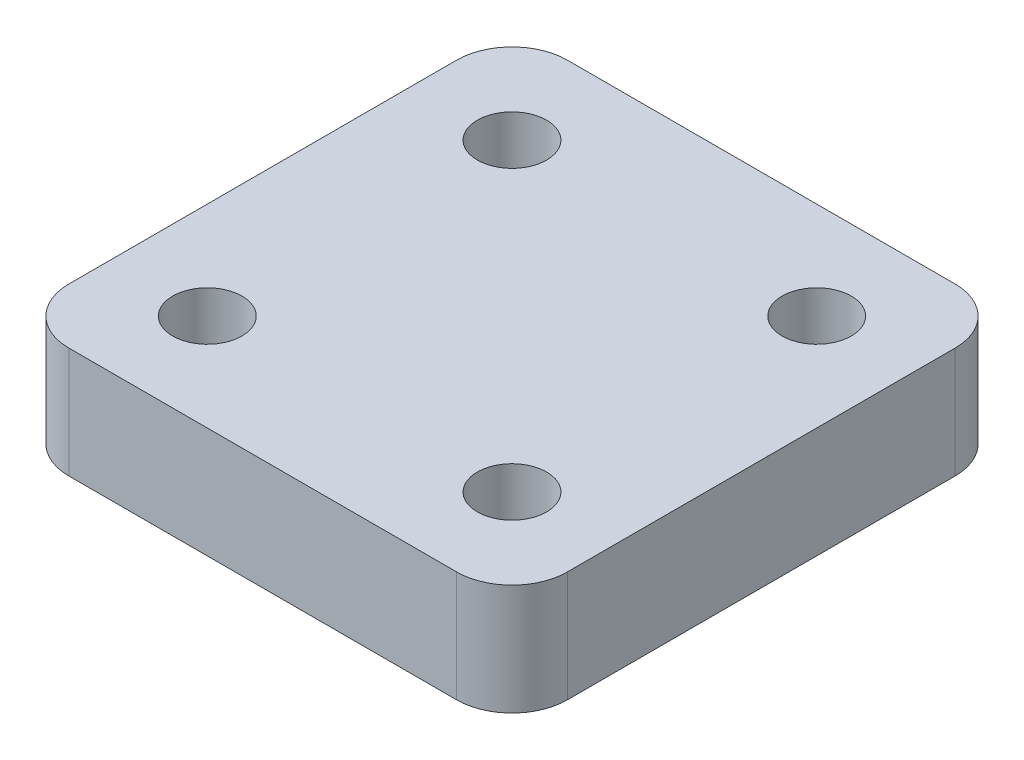
ISO-10303-21;
HEADER;
FILE_DESCRIPTION(('STEP AP214'),'2;1');
FILE_NAME('part.step','',(''),(''),'','','');
FILE_SCHEMA(('AUTOMOTIVE_DESIGN { 1 0 10303 214 1 1 1 1 }'));
ENDSEC;
DATA;
#1=APPLICATION_CONTEXT('core data for automotive mechanical design processes');
#2=APPLICATION_PROTOCOL_DEFINITION('international standard','automotive_design',2000,#1);
#3=PRODUCT_CONTEXT('',#1,'mechanical');
#4=PRODUCT('Part','Part','',(#3));
#5=PRODUCT_RELATED_PRODUCT_CATEGORY('part','',(#4));
#6=PRODUCT_DEFINITION_FORMATION('','',#4);
#7=PRODUCT_DEFINITION_CONTEXT('part definition',#1,'design');
#8=PRODUCT_DEFINITION('design','',#6,#7);
#9=PRODUCT_DEFINITION_SHAPE('','',#8);
#10=(LENGTH_UNIT() NAMED_UNIT(*) SI_UNIT(.MILLI.,.METRE.));
#11=(NAMED_UNIT(*) PLANE_ANGLE_UNIT() SI_UNIT($,.RADIAN.));
#12=(NAMED_UNIT(*) SI_UNIT($,.STERADIAN.) SOLID_ANGLE_UNIT());
#13=UNCERTAINTY_MEASURE_WITH_UNIT(LENGTH_MEASURE(1.E-05),#10,'distance_accuracy_value','');
#14=(GEOMETRIC_REPRESENTATION_CONTEXT(3) GLOBAL_UNCERTAINTY_ASSIGNED_CONTEXT((#13)) GLOBAL_UNIT_ASSIGNED_CONTEXT((#10,
#11,#12)) REPRESENTATION_CONTEXT('',''));
#15=CARTESIAN_POINT('',(0.,0.,0.));
#16=DIRECTION('',(0.,0.,1.));
#17=DIRECTION('',(1.,0.,0.));
#18=AXIS2_PLACEMENT_3D('',#15,#16,#17);
#19=CARTESIAN_POINT('',(700.,400.,-700.));
#20=DIRECTION('',(0.,1.,0.));
#21=DIRECTION('',(0.,0.,1.));
#22=AXIS2_PLACEMENT_3D('',#19,#20,#21);
#23=PLANE('',#22);
#24=CARTESIAN_POINT('',(-550.,400.,-550.));
#25=DIRECTION('',(0.,1.,0.));
#26=DIRECTION('',(0.,0.,1.));
#27=AXIS2_PLACEMENT_3D('',#24,#25,#26);
#28=CIRCLE('',#27,125.);
#29=CARTESIAN_POINT('',(-550.,400.,-425.));
#30=VERTEX_POINT('',#29);
#31=EDGE_CURVE('E193',#30,#30,#28,.T.);
#32=ORIENTED_EDGE('',*,*,#31,.F.);
#33=EDGE_LOOP('',(#32));
#34=FACE_BOUND('',#33,.T.);
#35=CARTESIAN_POINT('',(-550.,400.,550.));
#36=DIRECTION('',(0.,1.,0.));
#37=DIRECTION('',(0.,0.,1.));
#38=AXIS2_PLACEMENT_3D('',#35,#36,#37);
#39=CIRCLE('',#38,125.);
#40=CARTESIAN_POINT('',(-550.,400.,675.));
#41=VERTEX_POINT('',#40);
#42=EDGE_CURVE('E135',#41,#41,#39,.T.);
#43=ORIENTED_EDGE('',*,*,#42,.F.);
#44=EDGE_LOOP('',(#43));
#45=FACE_BOUND('',#44,.T.);
#46=CARTESIAN_POINT('',(700.,400.,-700.));
#47=DIRECTION('',(0.,1.,0.));
#48=DIRECTION('',(0.,0.,1.));
#49=AXIS2_PLACEMENT_3D('',#46,#47,#48);
#50=CIRCLE('',#49,200.);
#51=CARTESIAN_POINT('',(900.,400.,-699.999999999999));
#52=VERTEX_POINT('',#51);
#53=CARTESIAN_POINT('',(699.999999999998,400.,-900.));
#54=VERTEX_POINT('',#53);
#55=EDGE_CURVE('E146',#52,#54,#50,.T.);
#56=ORIENTED_EDGE('',*,*,#55,.T.);
#57=DIRECTION('',(-1.,0.,0.));
#58=VECTOR('',#57,1.);
#59=CARTESIAN_POINT('',(-699.999999999999,400.,-900.));
#60=LINE('',#59,#58);
#61=CARTESIAN_POINT('',(-700.,400.,-900.));
#62=VERTEX_POINT('',#61);
#63=EDGE_CURVE('E94',#54,#62,#60,.T.);
#64=ORIENTED_EDGE('',*,*,#63,.T.);
#65=CARTESIAN_POINT('',(-700.,400.,-700.));
#66=DIRECTION('',(0.,1.,0.));
#67=DIRECTION('',(0.,0.,-1.));
#68=AXIS2_PLACEMENT_3D('',#65,#66,#67);
#69=CIRCLE('',#68,200.);
#70=CARTESIAN_POINT('',(-900.,400.,-699.999999999999));
#71=VERTEX_POINT('',#70);
#72=EDGE_CURVE('E178',#62,#71,#69,.T.);
#73=ORIENTED_EDGE('',*,*,#72,.T.);
#74=DIRECTION('',(0.,0.,1.));
#75=VECTOR('',#74,1.);
#76=CARTESIAN_POINT('',(-900.,400.,-699.999999999999));
#77=LINE('',#76,#75);
#78=CARTESIAN_POINT('',(-900.,400.,699.999999999999));
#79=VERTEX_POINT('',#78);
#80=EDGE_CURVE('E177',#71,#79,#77,.T.);
#81=ORIENTED_EDGE('',*,*,#80,.T.);
#82=CARTESIAN_POINT('',(-700.,400.,700.));
#83=DIRECTION('',(0.,1.,0.));
#84=DIRECTION('',(0.,0.,1.));
#85=AXIS2_PLACEMENT_3D('',#82,#83,#84);
#86=CIRCLE('',#85,200.);
#87=CARTESIAN_POINT('',(-699.999999999999,400.,900.));
#88=VERTEX_POINT('',#87);
#89=EDGE_CURVE('E113',#79,#88,#86,.T.);
#90=ORIENTED_EDGE('',*,*,#89,.T.);
#91=DIRECTION('',(1.,0.,0.));
#92=VECTOR('',#91,1.);
#93=CARTESIAN_POINT('',(-699.999999999999,400.,900.));
#94=LINE('',#93,#92);
#95=CARTESIAN_POINT('',(699.999999999999,400.,900.));
#96=VERTEX_POINT('',#95);
#97=EDGE_CURVE('E107',#88,#96,#94,.T.);
#98=ORIENTED_EDGE('',*,*,#97,.T.);
#99=CARTESIAN_POINT('',(700.,400.,700.));
#100=DIRECTION('',(0.,1.,0.));
#101=DIRECTION('',(0.,0.,-1.));
#102=AXIS2_PLACEMENT_3D('',#99,#100,#101);
#103=CIRCLE('',#102,200.);
#104=CARTESIAN_POINT('',(900.,400.,699.999999999999));
#105=VERTEX_POINT('',#104);
#106=EDGE_CURVE('E111',#96,#105,#103,.T.);
#107=ORIENTED_EDGE('',*,*,#106,.T.);
#108=DIRECTION('',(0.,0.,-1.));
#109=VECTOR('',#108,1.);
#110=CARTESIAN_POINT('',(900.,400.,699.999999999999));
#111=LINE('',#110,#109);
#112=EDGE_CURVE('E50',#105,#52,#111,.T.);
#113=ORIENTED_EDGE('',*,*,#112,.T.);
#114=EDGE_LOOP('',(#56,#64,#73,#81,#90,#98,#107,#113));
#115=FACE_BOUND('',#114,.T.);
#116=CARTESIAN_POINT('',(550.,400.,550.));
#117=DIRECTION('',(0.,1.,0.));
#118=DIRECTION('',(0.,0.,1.));
#119=AXIS2_PLACEMENT_3D('',#116,#117,#118);
#120=CIRCLE('',#119,125.);
#121=CARTESIAN_POINT('',(550.,400.,675.));
#122=VERTEX_POINT('',#121);
#123=EDGE_CURVE('E187',#122,#122,#120,.T.);
#124=ORIENTED_EDGE('',*,*,#123,.F.);
#125=EDGE_LOOP('',(#124));
#126=FACE_BOUND('',#125,.T.);
#127=CARTESIAN_POINT('',(550.,400.,-550.));
#128=DIRECTION('',(0.,1.,0.));
#129=DIRECTION('',(0.,0.,1.));
#130=AXIS2_PLACEMENT_3D('',#127,#128,#129);
#131=CIRCLE('',#130,125.);
#132=CARTESIAN_POINT('',(550.,400.,-425.));
#133=VERTEX_POINT('',#132);
#134=EDGE_CURVE('E199',#133,#133,#131,.T.);
#135=ORIENTED_EDGE('',*,*,#134,.F.);
#136=EDGE_LOOP('',(#135));
#137=FACE_BOUND('',#136,.T.);
#138=ADVANCED_FACE('F33',(#34,#45,#115,#126,#137),#23,.T.);
#139=CARTESIAN_POINT('',(700.,0.,-700.));
#140=DIRECTION('',(0.,1.,0.));
#141=DIRECTION('',(0.,0.,1.));
#142=AXIS2_PLACEMENT_3D('',#139,#140,#141);
#143=PLANE('',#142);
#144=CARTESIAN_POINT('',(0.,0.,0.));
#145=DIRECTION('',(0.,1.,0.));
#146=DIRECTION('',(0.,0.,1.));
#147=AXIS2_PLACEMENT_3D('',#144,#145,#146);
#148=CIRCLE('',#147,540.);
#149=CARTESIAN_POINT('',(0.,0.,540.));
#150=VERTEX_POINT('',#149);
#151=EDGE_CURVE('E11',#150,#150,#148,.F.);
#152=ORIENTED_EDGE('',*,*,#151,.F.);
#153=EDGE_LOOP('',(#152));
#154=FACE_BOUND('',#153,.T.);
#155=CARTESIAN_POINT('',(700.,0.,-700.));
#156=DIRECTION('',(0.,1.,0.));
#157=DIRECTION('',(0.,0.,1.));
#158=AXIS2_PLACEMENT_3D('',#155,#156,#157);
#159=CIRCLE('',#158,200.);
#160=CARTESIAN_POINT('',(900.,0.,-699.999999999999));
#161=VERTEX_POINT('',#160);
#162=CARTESIAN_POINT('',(699.999999999998,0.,-900.));
#163=VERTEX_POINT('',#162);
#164=EDGE_CURVE('E131',#161,#163,#159,.T.);
#165=ORIENTED_EDGE('',*,*,#164,.F.);
#166=DIRECTION('',(0.,0.,-1.));
#167=VECTOR('',#166,1.);
#168=CARTESIAN_POINT('',(900.,0.,699.999999999999));
#169=LINE('',#168,#167);
#170=CARTESIAN_POINT('',(900.,0.,699.999999999999));
#171=VERTEX_POINT('',#170);
#172=EDGE_CURVE('E85',#171,#161,#169,.T.);
#173=ORIENTED_EDGE('',*,*,#172,.F.);
#174=CARTESIAN_POINT('',(700.,0.,700.));
#175=DIRECTION('',(0.,1.,0.));
#176=DIRECTION('',(0.,0.,-1.));
#177=AXIS2_PLACEMENT_3D('',#174,#175,#176);
#178=CIRCLE('',#177,200.);
#179=CARTESIAN_POINT('',(699.999999999999,0.,900.));
#180=VERTEX_POINT('',#179);
#181=EDGE_CURVE('E79',#180,#171,#178,.T.);
#182=ORIENTED_EDGE('',*,*,#181,.F.);
#183=DIRECTION('',(1.,0.,0.));
#184=VECTOR('',#183,1.);
#185=CARTESIAN_POINT('',(-699.999999999999,0.,900.));
#186=LINE('',#185,#184);
#187=CARTESIAN_POINT('',(-699.999999999999,0.,900.));
#188=VERTEX_POINT('',#187);
#189=EDGE_CURVE('E121',#188,#180,#186,.T.);
#190=ORIENTED_EDGE('',*,*,#189,.F.);
#191=CARTESIAN_POINT('',(-700.,0.,700.));
#192=DIRECTION('',(0.,1.,0.));
#193=DIRECTION('',(0.,0.,1.));
#194=AXIS2_PLACEMENT_3D('',#191,#192,#193);
#195=CIRCLE('',#194,200.);
#196=CARTESIAN_POINT('',(-900.,0.,699.999999999999));
#197=VERTEX_POINT('',#196);
#198=EDGE_CURVE('E141',#197,#188,#195,.T.);
#199=ORIENTED_EDGE('',*,*,#198,.F.);
#200=DIRECTION('',(0.,0.,1.));
#201=VECTOR('',#200,1.);
#202=CARTESIAN_POINT('',(-900.,0.,-699.999999999999));
#203=LINE('',#202,#201);
#204=CARTESIAN_POINT('',(-900.,0.,-699.999999999999));
#205=VERTEX_POINT('',#204);
#206=EDGE_CURVE('E139',#205,#197,#203,.T.);
#207=ORIENTED_EDGE('',*,*,#206,.F.);
#208=CARTESIAN_POINT('',(-700.,0.,-700.));
#209=DIRECTION('',(0.,1.,0.));
#210=DIRECTION('',(0.,0.,-1.));
#211=AXIS2_PLACEMENT_3D('',#208,#209,#210);
#212=CIRCLE('',#211,200.);
#213=CARTESIAN_POINT('',(-700.,0.,-900.));
#214=VERTEX_POINT('',#213);
#215=EDGE_CURVE('E137',#214,#205,#212,.T.);
#216=ORIENTED_EDGE('',*,*,#215,.F.);
#217=DIRECTION('',(-1.,0.,0.));
#218=VECTOR('',#217,1.);
#219=CARTESIAN_POINT('',(-699.999999999999,0.,-900.));
#220=LINE('',#219,#218);
#221=EDGE_CURVE('E134',#163,#214,#220,.T.);
#222=ORIENTED_EDGE('',*,*,#221,.F.);
#223=EDGE_LOOP('',(#165,#173,#182,#190,#199,#207,#216,#222));
#224=FACE_BOUND('',#223,.T.);
#225=CARTESIAN_POINT('',(-550.,0.,550.));
#226=DIRECTION('',(0.,1.,0.));
#227=DIRECTION('',(0.,0.,1.));
#228=AXIS2_PLACEMENT_3D('',#225,#226,#227);
#229=CIRCLE('',#228,125.);
#230=CARTESIAN_POINT('',(-550.,0.,675.));
#231=VERTEX_POINT('',#230);
#232=EDGE_CURVE('E184',#231,#231,#229,.T.);
#233=ORIENTED_EDGE('',*,*,#232,.T.);
#234=EDGE_LOOP('',(#233));
#235=FACE_BOUND('',#234,.T.);
#236=CARTESIAN_POINT('',(550.,0.,550.));
#237=DIRECTION('',(0.,1.,0.));
#238=DIRECTION('',(0.,0.,1.));
#239=AXIS2_PLACEMENT_3D('',#236,#237,#238);
#240=CIRCLE('',#239,125.);
#241=CARTESIAN_POINT('',(550.,0.,675.));
#242=VERTEX_POINT('',#241);
#243=EDGE_CURVE('E190',#242,#242,#240,.T.);
#244=ORIENTED_EDGE('',*,*,#243,.T.);
#245=EDGE_LOOP('',(#244));
#246=FACE_BOUND('',#245,.T.);
#247=CARTESIAN_POINT('',(-550.,0.,-550.));
#248=DIRECTION('',(0.,1.,0.));
#249=DIRECTION('',(0.,0.,1.));
#250=AXIS2_PLACEMENT_3D('',#247,#248,#249);
#251=CIRCLE('',#250,125.);
#252=CARTESIAN_POINT('',(-550.,0.,-425.));
#253=VERTEX_POINT('',#252);
#254=EDGE_CURVE('E196',#253,#253,#251,.T.);
#255=ORIENTED_EDGE('',*,*,#254,.T.);
#256=EDGE_LOOP('',(#255));
#257=FACE_BOUND('',#256,.T.);
#258=CARTESIAN_POINT('',(550.,0.,-550.));
#259=DIRECTION('',(0.,1.,0.));
#260=DIRECTION('',(0.,0.,1.));
#261=AXIS2_PLACEMENT_3D('',#258,#259,#260);
#262=CIRCLE('',#261,125.);
#263=CARTESIAN_POINT('',(550.,0.,-425.));
#264=VERTEX_POINT('',#263);
#265=EDGE_CURVE('E202',#264,#264,#262,.T.);
#266=ORIENTED_EDGE('',*,*,#265,.T.);
#267=EDGE_LOOP('',(#266));
#268=FACE_BOUND('',#267,.T.);
#269=ADVANCED_FACE('F164',(#154,#224,#235,#246,#257,#268),#143,.F.);
#270=CARTESIAN_POINT('',(700.,400.,-700.));
#271=DIRECTION('',(0.,-1.,0.));
#272=DIRECTION('',(0.,0.,-1.));
#273=AXIS2_PLACEMENT_3D('',#270,#271,#272);
#274=CYLINDRICAL_SURFACE('',#273,200.);
#275=ORIENTED_EDGE('',*,*,#164,.T.);
#276=DIRECTION('',(0.,-1.,0.));
#277=VECTOR('',#276,1.);
#278=CARTESIAN_POINT('',(699.999999999998,400.,-900.));
#279=LINE('',#278,#277);
#280=EDGE_CURVE('E42',#54,#163,#279,.T.);
#281=ORIENTED_EDGE('',*,*,#280,.F.);
#282=ORIENTED_EDGE('',*,*,#55,.F.);
#283=DIRECTION('',(0.,-1.,0.));
#284=VECTOR('',#283,1.);
#285=CARTESIAN_POINT('',(900.,400.,-699.999999999999));
#286=LINE('',#285,#284);
#287=EDGE_CURVE('E127',#52,#161,#286,.T.);
#288=ORIENTED_EDGE('',*,*,#287,.T.);
#289=EDGE_LOOP('',(#275,#281,#282,#288));
#290=FACE_BOUND('',#289,.T.);
#291=ADVANCED_FACE('F35',(#290),#274,.T.);
#292=CARTESIAN_POINT('',(-699.999999999999,400.,-900.));
#293=DIRECTION('',(0.,0.,1.));
#294=DIRECTION('',(1.,0.,0.));
#295=AXIS2_PLACEMENT_3D('',#292,#293,#294);
#296=PLANE('',#295);
#297=ORIENTED_EDGE('',*,*,#221,.T.);
#298=DIRECTION('',(0.,-1.,0.));
#299=VECTOR('',#298,1.);
#300=CARTESIAN_POINT('',(-700.,400.,-900.));
#301=LINE('',#300,#299);
#302=EDGE_CURVE('E156',#62,#214,#301,.T.);
#303=ORIENTED_EDGE('',*,*,#302,.F.);
#304=ORIENTED_EDGE('',*,*,#63,.F.);
#305=ORIENTED_EDGE('',*,*,#280,.T.);
#306=EDGE_LOOP('',(#297,#303,#304,#305));
#307=FACE_BOUND('',#306,.T.);
#308=ADVANCED_FACE('F159',(#307),#296,.F.);
#309=CARTESIAN_POINT('',(-700.,400.,-700.));
#310=DIRECTION('',(0.,-1.,0.));
#311=DIRECTION('',(0.,0.,-1.));
#312=AXIS2_PLACEMENT_3D('',#309,#310,#311);
#313=CYLINDRICAL_SURFACE('',#312,200.);
#314=ORIENTED_EDGE('',*,*,#215,.T.);
#315=DIRECTION('',(0.,-1.,0.));
#316=VECTOR('',#315,1.);
#317=CARTESIAN_POINT('',(-900.,400.,-699.999999999999));
#318=LINE('',#317,#316);
#319=EDGE_CURVE('E153',#71,#205,#318,.T.);
#320=ORIENTED_EDGE('',*,*,#319,.F.);
#321=ORIENTED_EDGE('',*,*,#72,.F.);
#322=ORIENTED_EDGE('',*,*,#302,.T.);
#323=EDGE_LOOP('',(#314,#320,#321,#322));
#324=FACE_BOUND('',#323,.T.);
#325=ADVANCED_FACE('F171',(#324),#313,.T.);
#326=CARTESIAN_POINT('',(-900.,400.,-699.999999999999));
#327=DIRECTION('',(1.,0.,0.));
#328=DIRECTION('',(0.,0.,-1.));
#329=AXIS2_PLACEMENT_3D('',#326,#327,#328);
#330=PLANE('',#329);
#331=ORIENTED_EDGE('',*,*,#206,.T.);
#332=DIRECTION('',(0.,-1.,0.));
#333=VECTOR('',#332,1.);
#334=CARTESIAN_POINT('',(-900.,400.,699.999999999999));
#335=LINE('',#334,#333);
#336=EDGE_CURVE('E150',#79,#197,#335,.T.);
#337=ORIENTED_EDGE('',*,*,#336,.F.);
#338=ORIENTED_EDGE('',*,*,#80,.F.);
#339=ORIENTED_EDGE('',*,*,#319,.T.);
#340=EDGE_LOOP('',(#331,#337,#338,#339));
#341=FACE_BOUND('',#340,.T.);
#342=ADVANCED_FACE('F175',(#341),#330,.F.);
#343=CARTESIAN_POINT('',(-700.,400.,700.));
#344=DIRECTION('',(0.,-1.,0.));
#345=DIRECTION('',(0.,0.,-1.));
#346=AXIS2_PLACEMENT_3D('',#343,#344,#345);
#347=CYLINDRICAL_SURFACE('',#346,200.);
#348=ORIENTED_EDGE('',*,*,#198,.T.);
#349=DIRECTION('',(0.,-1.,0.));
#350=VECTOR('',#349,1.);
#351=CARTESIAN_POINT('',(-699.999999999999,400.,900.));
#352=LINE('',#351,#350);
#353=EDGE_CURVE('E122',#88,#188,#352,.T.);
#354=ORIENTED_EDGE('',*,*,#353,.F.);
#355=ORIENTED_EDGE('',*,*,#89,.F.);
#356=ORIENTED_EDGE('',*,*,#336,.T.);
#357=EDGE_LOOP('',(#348,#354,#355,#356));
#358=FACE_BOUND('',#357,.T.);
#359=ADVANCED_FACE('F240',(#358),#347,.T.);
#360=CARTESIAN_POINT('',(-699.999999999999,400.,900.));
#361=DIRECTION('',(0.,0.,-1.));
#362=DIRECTION('',(-1.,0.,0.));
#363=AXIS2_PLACEMENT_3D('',#360,#361,#362);
#364=PLANE('',#363);
#365=ORIENTED_EDGE('',*,*,#189,.T.);
#366=DIRECTION('',(0.,-1.,0.));
#367=VECTOR('',#366,1.);
#368=CARTESIAN_POINT('',(699.999999999999,400.,900.));
#369=LINE('',#368,#367);
#370=EDGE_CURVE('E118',#96,#180,#369,.T.);
#371=ORIENTED_EDGE('',*,*,#370,.F.);
#372=ORIENTED_EDGE('',*,*,#97,.F.);
#373=ORIENTED_EDGE('',*,*,#353,.T.);
#374=EDGE_LOOP('',(#365,#371,#372,#373));
#375=FACE_BOUND('',#374,.T.);
#376=ADVANCED_FACE('F119',(#375),#364,.F.);
#377=CARTESIAN_POINT('',(700.,400.,700.));
#378=DIRECTION('',(0.,-1.,0.));
#379=DIRECTION('',(0.,0.,-1.));
#380=AXIS2_PLACEMENT_3D('',#377,#378,#379);
#381=CYLINDRICAL_SURFACE('',#380,200.);
#382=ORIENTED_EDGE('',*,*,#181,.T.);
#383=DIRECTION('',(0.,-1.,0.));
#384=VECTOR('',#383,1.);
#385=CARTESIAN_POINT('',(900.,400.,699.999999999999));
#386=LINE('',#385,#384);
#387=EDGE_CURVE('E123',#105,#171,#386,.T.);
#388=ORIENTED_EDGE('',*,*,#387,.F.);
#389=ORIENTED_EDGE('',*,*,#106,.F.);
#390=ORIENTED_EDGE('',*,*,#370,.T.);
#391=EDGE_LOOP('',(#382,#388,#389,#390));
#392=FACE_BOUND('',#391,.T.);
#393=ADVANCED_FACE('F125',(#392),#381,.T.);
#394=CARTESIAN_POINT('',(900.,400.,699.999999999999));
#395=DIRECTION('',(-1.,0.,0.));
#396=DIRECTION('',(0.,0.,1.));
#397=AXIS2_PLACEMENT_3D('',#394,#395,#396);
#398=PLANE('',#397);
#399=ORIENTED_EDGE('',*,*,#172,.T.);
#400=ORIENTED_EDGE('',*,*,#287,.F.);
#401=ORIENTED_EDGE('',*,*,#112,.F.);
#402=ORIENTED_EDGE('',*,*,#387,.T.);
#403=EDGE_LOOP('',(#399,#400,#401,#402));
#404=FACE_BOUND('',#403,.T.);
#405=ADVANCED_FACE('F232',(#404),#398,.F.);
#406=CARTESIAN_POINT('',(-550.,400.,550.));
#407=DIRECTION('',(0.,-1.,0.));
#408=DIRECTION('',(0.,0.,-1.));
#409=AXIS2_PLACEMENT_3D('',#406,#407,#408);
#410=CYLINDRICAL_SURFACE('',#409,125.);
#411=ORIENTED_EDGE('',*,*,#42,.T.);
#412=EDGE_LOOP('',(#411));
#413=FACE_BOUND('',#412,.T.);
#414=ORIENTED_EDGE('',*,*,#232,.F.);
#415=EDGE_LOOP('',(#414));
#416=FACE_BOUND('',#415,.T.);
#417=ADVANCED_FACE('F235',(#413,#416),#410,.F.);
#418=CARTESIAN_POINT('',(550.,400.,550.));
#419=DIRECTION('',(0.,-1.,0.));
#420=DIRECTION('',(0.,0.,-1.));
#421=AXIS2_PLACEMENT_3D('',#418,#419,#420);
#422=CYLINDRICAL_SURFACE('',#421,125.);
#423=ORIENTED_EDGE('',*,*,#123,.T.);
#424=EDGE_LOOP('',(#423));
#425=FACE_BOUND('',#424,.T.);
#426=ORIENTED_EDGE('',*,*,#243,.F.);
#427=EDGE_LOOP('',(#426));
#428=FACE_BOUND('',#427,.T.);
#429=ADVANCED_FACE('F282',(#425,#428),#422,.F.);
#430=CARTESIAN_POINT('',(-550.,400.,-550.));
#431=DIRECTION('',(0.,-1.,0.));
#432=DIRECTION('',(0.,0.,-1.));
#433=AXIS2_PLACEMENT_3D('',#430,#431,#432);
#434=CYLINDRICAL_SURFACE('',#433,125.);
#435=ORIENTED_EDGE('',*,*,#31,.T.);
#436=EDGE_LOOP('',(#435));
#437=FACE_BOUND('',#436,.T.);
#438=ORIENTED_EDGE('',*,*,#254,.F.);
#439=EDGE_LOOP('',(#438));
#440=FACE_BOUND('',#439,.T.);
#441=ADVANCED_FACE('F289',(#437,#440),#434,.F.);
#442=CARTESIAN_POINT('',(550.,400.,-550.));
#443=DIRECTION('',(0.,-1.,0.));
#444=DIRECTION('',(0.,0.,-1.));
#445=AXIS2_PLACEMENT_3D('',#442,#443,#444);
#446=CYLINDRICAL_SURFACE('',#445,125.);
#447=ORIENTED_EDGE('',*,*,#134,.T.);
#448=EDGE_LOOP('',(#447));
#449=FACE_BOUND('',#448,.T.);
#450=ORIENTED_EDGE('',*,*,#265,.F.);
#451=EDGE_LOOP('',(#450));
#452=FACE_BOUND('',#451,.T.);
#453=ADVANCED_FACE('F216',(#449,#452),#446,.F.);
#454=CARTESIAN_POINT('',(0.,-150.,0.));
#455=DIRECTION('',(0.,1.,0.));
#456=DIRECTION('',(0.,0.,1.));
#457=AXIS2_PLACEMENT_3D('',#454,#455,#456);
#458=CYLINDRICAL_SURFACE('',#457,540.);
#459=CARTESIAN_POINT('',(0.,-150.,0.));
#460=DIRECTION('',(0.,-1.,0.));
#461=DIRECTION('',(0.,0.,-1.));
#462=AXIS2_PLACEMENT_3D('',#459,#460,#461);
#463=CIRCLE('',#462,540.);
#464=CARTESIAN_POINT('',(0.,-150.,-540.));
#465=VERTEX_POINT('',#464);
#466=EDGE_CURVE('E205',#465,#465,#463,.T.);
#467=ORIENTED_EDGE('',*,*,#466,.F.);
#468=EDGE_LOOP('',(#467));
#469=FACE_BOUND('',#468,.T.);
#470=ORIENTED_EDGE('',*,*,#151,.T.);
#471=EDGE_LOOP('',(#470));
#472=FACE_BOUND('',#471,.T.);
#473=ADVANCED_FACE('F213',(#469,#472),#458,.T.);
#474=CARTESIAN_POINT('',(0.,-150.,0.));
#475=DIRECTION('',(0.,-1.,0.));
#476=DIRECTION('',(0.,0.,-1.));
#477=AXIS2_PLACEMENT_3D('',#474,#475,#476);
#478=PLANE('',#477);
#479=ORIENTED_EDGE('',*,*,#466,.T.);
#480=EDGE_LOOP('',(#479));
#481=FACE_BOUND('',#480,.T.);
#482=ADVANCED_FACE('F211',(#481),#478,.T.);
#483=CLOSED_SHELL('',(#138,#269,#291,#308,#325,#342,#359,#376,#393,#405,#417,#429,#441,#453,
#473,#482));
#484=MANIFOLD_SOLID_BREP('B2',#483);
#485=ADVANCED_BREP_SHAPE_REPRESENTATION('',(#18,#484),#14);
#486=SHAPE_DEFINITION_REPRESENTATION(#9,#485);
ENDSEC;
END-ISO-10303-21;
